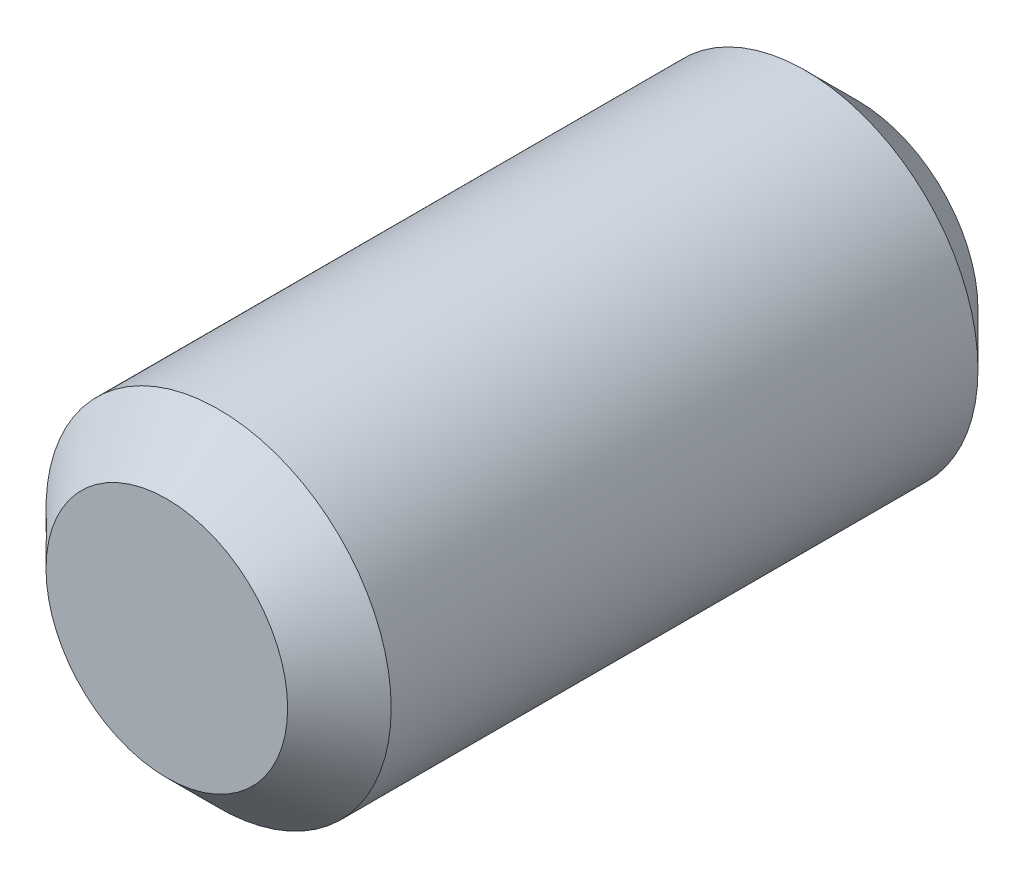
ISO-10303-21;
HEADER;
FILE_DESCRIPTION(('STEP AP214'),'2;1');
FILE_NAME('part.step','',(''),(''),'','','');
FILE_SCHEMA(('AUTOMOTIVE_DESIGN { 1 0 10303 214 1 1 1 1 }'));
ENDSEC;
DATA;
#1=APPLICATION_CONTEXT('core data for automotive mechanical design processes');
#2=APPLICATION_PROTOCOL_DEFINITION('international standard','automotive_design',2000,#1);
#3=PRODUCT_CONTEXT('',#1,'mechanical');
#4=PRODUCT('Part','Part','',(#3));
#5=PRODUCT_RELATED_PRODUCT_CATEGORY('part','',(#4));
#6=PRODUCT_DEFINITION_FORMATION('','',#4);
#7=PRODUCT_DEFINITION_CONTEXT('part definition',#1,'design');
#8=PRODUCT_DEFINITION('design','',#6,#7);
#9=PRODUCT_DEFINITION_SHAPE('','',#8);
#10=(LENGTH_UNIT() NAMED_UNIT(*) SI_UNIT(.MILLI.,.METRE.));
#11=(NAMED_UNIT(*) PLANE_ANGLE_UNIT() SI_UNIT($,.RADIAN.));
#12=(NAMED_UNIT(*) SI_UNIT($,.STERADIAN.) SOLID_ANGLE_UNIT());
#13=UNCERTAINTY_MEASURE_WITH_UNIT(LENGTH_MEASURE(1.E-05),#10,'distance_accuracy_value','');
#14=(GEOMETRIC_REPRESENTATION_CONTEXT(3) GLOBAL_UNCERTAINTY_ASSIGNED_CONTEXT((#13)) GLOBAL_UNIT_ASSIGNED_CONTEXT((#10,
#11,#12)) REPRESENTATION_CONTEXT('',''));
#15=CARTESIAN_POINT('',(0.,0.,0.));
#16=DIRECTION('',(0.,0.,1.));
#17=DIRECTION('',(1.,0.,0.));
#18=AXIS2_PLACEMENT_3D('',#15,#16,#17);
#19=CARTESIAN_POINT('',(0.,0.,4.));
#20=DIRECTION('',(0.,0.,-1.));
#21=DIRECTION('',(-1.,0.,0.));
#22=AXIS2_PLACEMENT_3D('',#19,#20,#21);
#23=CYLINDRICAL_SURFACE('',#22,1.);
#24=CARTESIAN_POINT('',(0.,0.,0.3));
#25=DIRECTION('',(0.,0.,1.));
#26=DIRECTION('',(1.,0.,0.));
#27=AXIS2_PLACEMENT_3D('',#24,#25,#26);
#28=CIRCLE('',#27,1.);
#29=CARTESIAN_POINT('',(1.,0.,0.3));
#30=VERTEX_POINT('',#29);
#31=EDGE_CURVE('E53',#30,#30,#28,.T.);
#32=ORIENTED_EDGE('',*,*,#31,.T.);
#33=EDGE_LOOP('',(#32));
#34=FACE_BOUND('',#33,.T.);
#35=CARTESIAN_POINT('',(0.,0.,3.7));
#36=DIRECTION('',(0.,0.,1.));
#37=DIRECTION('',(1.,0.,0.));
#38=AXIS2_PLACEMENT_3D('',#35,#36,#37);
#39=CIRCLE('',#38,1.);
#40=CARTESIAN_POINT('',(1.,0.,3.7));
#41=VERTEX_POINT('',#40);
#42=EDGE_CURVE('E58',#41,#41,#39,.F.);
#43=ORIENTED_EDGE('',*,*,#42,.T.);
#44=EDGE_LOOP('',(#43));
#45=FACE_BOUND('',#44,.T.);
#46=ADVANCED_FACE('F39',(#34,#45),#23,.T.);
#47=CARTESIAN_POINT('',(0.,0.,4.));
#48=DIRECTION('',(0.,0.,1.));
#49=DIRECTION('',(1.,0.,0.));
#50=AXIS2_PLACEMENT_3D('',#47,#48,#49);
#51=PLANE('',#50);
#52=CARTESIAN_POINT('',(0.,0.,4.));
#53=DIRECTION('',(0.,0.,1.));
#54=DIRECTION('',(1.,0.,0.));
#55=AXIS2_PLACEMENT_3D('',#52,#53,#54);
#56=CIRCLE('',#55,0.700000000000001);
#57=CARTESIAN_POINT('',(0.700000000000001,0.,4.));
#58=VERTEX_POINT('',#57);
#59=EDGE_CURVE('E10',#58,#58,#56,.T.);
#60=ORIENTED_EDGE('',*,*,#59,.T.);
#61=EDGE_LOOP('',(#60));
#62=FACE_BOUND('',#61,.T.);
#63=ADVANCED_FACE('F75',(#62),#51,.T.);
#64=CARTESIAN_POINT('',(0.,0.,0.));
#65=DIRECTION('',(0.,0.,1.));
#66=DIRECTION('',(1.,0.,0.));
#67=AXIS2_PLACEMENT_3D('',#64,#65,#66);
#68=PLANE('',#67);
#69=CARTESIAN_POINT('',(0.,0.,0.));
#70=DIRECTION('',(0.,0.,1.));
#71=DIRECTION('',(1.,0.,0.));
#72=AXIS2_PLACEMENT_3D('',#69,#70,#71);
#73=CIRCLE('',#72,0.699999999999998);
#74=CARTESIAN_POINT('',(0.699999999999998,0.,0.));
#75=VERTEX_POINT('',#74);
#76=EDGE_CURVE('E48',#75,#75,#73,.F.);
#77=ORIENTED_EDGE('',*,*,#76,.T.);
#78=EDGE_LOOP('',(#77));
#79=FACE_BOUND('',#78,.T.);
#80=ADVANCED_FACE('F72',(#79),#68,.F.);
#81=CARTESIAN_POINT('',(0.,0.,0.3));
#82=DIRECTION('',(0.,0.,1.));
#83=DIRECTION('',(1.,0.,0.));
#84=AXIS2_PLACEMENT_3D('',#81,#82,#83);
#85=CONICAL_SURFACE('',#84,1.,0.78539816339745);
#86=ORIENTED_EDGE('',*,*,#76,.F.);
#87=EDGE_LOOP('',(#86));
#88=FACE_BOUND('',#87,.T.);
#89=ORIENTED_EDGE('',*,*,#31,.F.);
#90=EDGE_LOOP('',(#89));
#91=FACE_BOUND('',#90,.T.);
#92=ADVANCED_FACE('F68',(#88,#91),#85,.T.);
#93=CARTESIAN_POINT('',(0.,0.,4.));
#94=DIRECTION('',(0.,0.,-1.));
#95=DIRECTION('',(-1.,0.,0.));
#96=AXIS2_PLACEMENT_3D('',#93,#94,#95);
#97=CONICAL_SURFACE('',#96,0.700000000000001,0.785398163397446);
#98=ORIENTED_EDGE('',*,*,#42,.F.);
#99=EDGE_LOOP('',(#98));
#100=FACE_BOUND('',#99,.T.);
#101=ORIENTED_EDGE('',*,*,#59,.F.);
#102=EDGE_LOOP('',(#101));
#103=FACE_BOUND('',#102,.T.);
#104=ADVANCED_FACE('F42',(#100,#103),#97,.T.);
#105=CLOSED_SHELL('',(#46,#63,#80,#92,#104));
#106=MANIFOLD_SOLID_BREP('B2',#105);
#107=ADVANCED_BREP_SHAPE_REPRESENTATION('',(#18,#106),#14);
#108=SHAPE_DEFINITION_REPRESENTATION(#9,#107);
ENDSEC;
END-ISO-10303-21;
